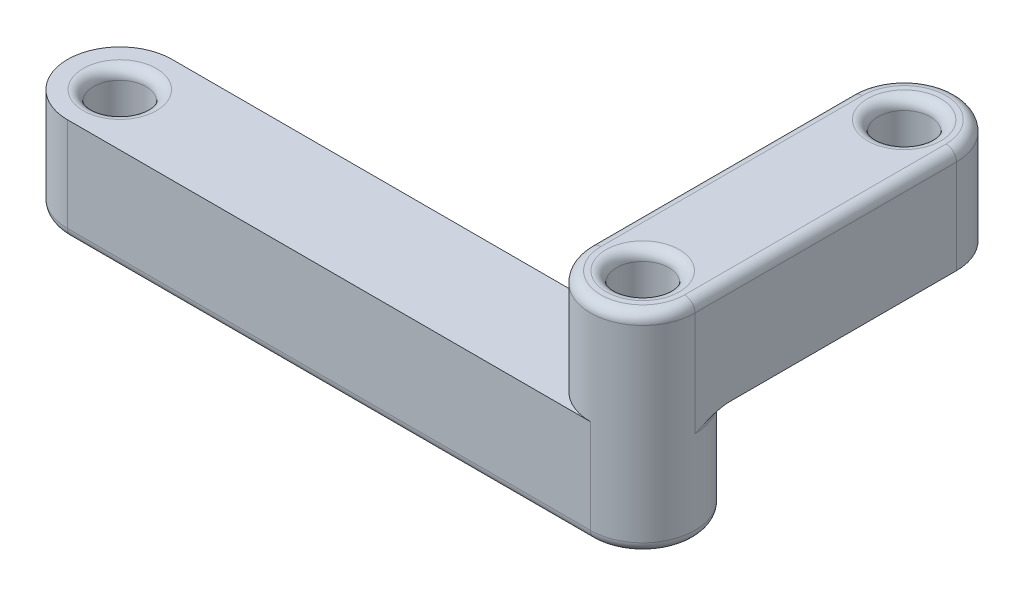
ISO-10303-21;
HEADER;
FILE_DESCRIPTION(('STEP AP214'),'2;1');
FILE_NAME('part.step','',(''),(''),'','','');
FILE_SCHEMA(('AUTOMOTIVE_DESIGN { 1 0 10303 214 1 1 1 1 }'));
ENDSEC;
DATA;
#1=APPLICATION_CONTEXT('core data for automotive mechanical design processes');
#2=APPLICATION_PROTOCOL_DEFINITION('international standard','automotive_design',2000,#1);
#3=PRODUCT_CONTEXT('',#1,'mechanical');
#4=PRODUCT('Part','Part','',(#3));
#5=PRODUCT_RELATED_PRODUCT_CATEGORY('part','',(#4));
#6=PRODUCT_DEFINITION_FORMATION('','',#4);
#7=PRODUCT_DEFINITION_CONTEXT('part definition',#1,'design');
#8=PRODUCT_DEFINITION('design','',#6,#7);
#9=PRODUCT_DEFINITION_SHAPE('','',#8);
#10=(LENGTH_UNIT() NAMED_UNIT(*) SI_UNIT(.MILLI.,.METRE.));
#11=(NAMED_UNIT(*) PLANE_ANGLE_UNIT() SI_UNIT($,.RADIAN.));
#12=(NAMED_UNIT(*) SI_UNIT($,.STERADIAN.) SOLID_ANGLE_UNIT());
#13=UNCERTAINTY_MEASURE_WITH_UNIT(LENGTH_MEASURE(1.E-05),#10,'distance_accuracy_value','');
#14=(GEOMETRIC_REPRESENTATION_CONTEXT(3) GLOBAL_UNCERTAINTY_ASSIGNED_CONTEXT((#13)) GLOBAL_UNIT_ASSIGNED_CONTEXT((#10,
#11,#12)) REPRESENTATION_CONTEXT('',''));
#15=CARTESIAN_POINT('',(0.,0.,0.));
#16=DIRECTION('',(0.,0.,1.));
#17=DIRECTION('',(1.,0.,0.));
#18=AXIS2_PLACEMENT_3D('',#15,#16,#17);
#19=CARTESIAN_POINT('',(0.,10.,0.));
#20=DIRECTION('',(0.,1.,0.));
#21=DIRECTION('',(0.,0.,1.));
#22=AXIS2_PLACEMENT_3D('',#19,#20,#21);
#23=PLANE('',#22);
#24=CARTESIAN_POINT('',(0.,10.,0.));
#25=DIRECTION('',(0.,1.,0.));
#26=DIRECTION('',(0.,0.,1.));
#27=AXIS2_PLACEMENT_3D('',#24,#25,#26);
#28=CIRCLE('',#27,3.5);
#29=CARTESIAN_POINT('',(0.,10.,3.5));
#30=VERTEX_POINT('',#29);
#31=EDGE_CURVE('E322',#30,#30,#28,.F.);
#32=ORIENTED_EDGE('',*,*,#31,.T.);
#33=EDGE_LOOP('',(#32));
#34=FACE_BOUND('',#33,.T.);
#35=CARTESIAN_POINT('',(50.,10.,0.));
#36=DIRECTION('',(0.,1.,0.));
#37=DIRECTION('',(0.,0.,1.));
#38=AXIS2_PLACEMENT_3D('',#35,#36,#37);
#39=CIRCLE('',#38,5.);
#40=CARTESIAN_POINT('',(45.,10.,0.));
#41=VERTEX_POINT('',#40);
#42=CARTESIAN_POINT('',(50.,10.,5.));
#43=VERTEX_POINT('',#42);
#44=EDGE_CURVE('E169',#41,#43,#39,.T.);
#45=ORIENTED_EDGE('',*,*,#44,.F.);
#46=DIRECTION('',(0.,0.,1.));
#47=VECTOR('',#46,1.);
#48=CARTESIAN_POINT('',(45.,10.,0.));
#49=LINE('',#48,#47);
#50=CARTESIAN_POINT('',(45.,10.,-5.));
#51=VERTEX_POINT('',#50);
#52=EDGE_CURVE('E180',#51,#41,#49,.T.);
#53=ORIENTED_EDGE('',*,*,#52,.F.);
#54=DIRECTION('',(-1.,0.,0.));
#55=VECTOR('',#54,1.);
#56=CARTESIAN_POINT('',(0.,10.,-5.));
#57=LINE('',#56,#55);
#58=CARTESIAN_POINT('',(0.,10.,-5.));
#59=VERTEX_POINT('',#58);
#60=EDGE_CURVE('E196',#51,#59,#57,.T.);
#61=ORIENTED_EDGE('',*,*,#60,.T.);
#62=CARTESIAN_POINT('',(0.,10.,0.));
#63=DIRECTION('',(0.,1.,0.));
#64=DIRECTION('',(0.,0.,1.));
#65=AXIS2_PLACEMENT_3D('',#62,#63,#64);
#66=CIRCLE('',#65,5.);
#67=CARTESIAN_POINT('',(0.,10.,5.));
#68=VERTEX_POINT('',#67);
#69=EDGE_CURVE('E189',#59,#68,#66,.T.);
#70=ORIENTED_EDGE('',*,*,#69,.T.);
#71=DIRECTION('',(1.,0.,0.));
#72=VECTOR('',#71,1.);
#73=CARTESIAN_POINT('',(0.,10.,5.));
#74=LINE('',#73,#72);
#75=EDGE_CURVE('E193',#68,#43,#74,.T.);
#76=ORIENTED_EDGE('',*,*,#75,.T.);
#77=EDGE_LOOP('',(#45,#53,#61,#70,#76));
#78=FACE_BOUND('',#77,.T.);
#79=ADVANCED_FACE('F38',(#34,#78),#23,.T.);
#80=CARTESIAN_POINT('',(0.,0.,0.));
#81=DIRECTION('',(0.,1.,0.));
#82=DIRECTION('',(0.,0.,1.));
#83=AXIS2_PLACEMENT_3D('',#80,#81,#82);
#84=PLANE('',#83);
#85=CARTESIAN_POINT('',(50.,0.,0.));
#86=DIRECTION('',(0.,1.,0.));
#87=DIRECTION('',(0.,0.,1.));
#88=AXIS2_PLACEMENT_3D('',#85,#86,#87);
#89=CIRCLE('',#88,3.5);
#90=CARTESIAN_POINT('',(50.,0.,3.5));
#91=VERTEX_POINT('',#90);
#92=EDGE_CURVE('E304',#91,#91,#89,.T.);
#93=ORIENTED_EDGE('',*,*,#92,.T.);
#94=EDGE_LOOP('',(#93));
#95=FACE_BOUND('',#94,.T.);
#96=CARTESIAN_POINT('',(0.,0.,0.));
#97=DIRECTION('',(0.,1.,0.));
#98=DIRECTION('',(0.,0.,1.));
#99=AXIS2_PLACEMENT_3D('',#96,#97,#98);
#100=CIRCLE('',#99,3.5);
#101=CARTESIAN_POINT('',(0.,0.,3.5));
#102=VERTEX_POINT('',#101);
#103=EDGE_CURVE('E300',#102,#102,#100,.T.);
#104=ORIENTED_EDGE('',*,*,#103,.T.);
#105=EDGE_LOOP('',(#104));
#106=FACE_BOUND('',#105,.T.);
#107=CARTESIAN_POINT('',(50.,0.,0.));
#108=DIRECTION('',(0.,1.,0.));
#109=DIRECTION('',(0.,0.,1.));
#110=AXIS2_PLACEMENT_3D('',#107,#108,#109);
#111=CIRCLE('',#110,4.);
#112=CARTESIAN_POINT('',(50.,0.,-4.));
#113=VERTEX_POINT('',#112);
#114=CARTESIAN_POINT('',(50.,0.,4.));
#115=VERTEX_POINT('',#114);
#116=EDGE_CURVE('E293',#113,#115,#111,.F.);
#117=ORIENTED_EDGE('',*,*,#116,.T.);
#118=DIRECTION('',(1.,0.,0.));
#119=VECTOR('',#118,1.);
#120=CARTESIAN_POINT('',(0.,0.,4.));
#121=LINE('',#120,#119);
#122=CARTESIAN_POINT('',(0.,0.,4.));
#123=VERTEX_POINT('',#122);
#124=EDGE_CURVE('E296',#115,#123,#121,.F.);
#125=ORIENTED_EDGE('',*,*,#124,.T.);
#126=CARTESIAN_POINT('',(0.,0.,0.));
#127=DIRECTION('',(0.,1.,0.));
#128=DIRECTION('',(0.,0.,1.));
#129=AXIS2_PLACEMENT_3D('',#126,#127,#128);
#130=CIRCLE('',#129,4.);
#131=CARTESIAN_POINT('',(0.,0.,-4.));
#132=VERTEX_POINT('',#131);
#133=EDGE_CURVE('E287',#123,#132,#130,.F.);
#134=ORIENTED_EDGE('',*,*,#133,.T.);
#135=DIRECTION('',(-1.,0.,0.));
#136=VECTOR('',#135,1.);
#137=CARTESIAN_POINT('',(0.,0.,-4.));
#138=LINE('',#137,#136);
#139=EDGE_CURVE('E290',#132,#113,#138,.F.);
#140=ORIENTED_EDGE('',*,*,#139,.T.);
#141=EDGE_LOOP('',(#117,#125,#134,#140));
#142=FACE_BOUND('',#141,.T.);
#143=ADVANCED_FACE('F357',(#95,#106,#142),#84,.F.);
#144=CARTESIAN_POINT('',(0.,10.,0.));
#145=DIRECTION('',(0.,-1.,0.));
#146=DIRECTION('',(0.,0.,-1.));
#147=AXIS2_PLACEMENT_3D('',#144,#145,#146);
#148=CYLINDRICAL_SURFACE('',#147,5.);
#149=DIRECTION('',(0.,-1.,0.));
#150=VECTOR('',#149,1.);
#151=CARTESIAN_POINT('',(0.,10.,-5.));
#152=LINE('',#151,#150);
#153=CARTESIAN_POINT('',(0.,0.999999999999999,-5.));
#154=VERTEX_POINT('',#153);
#155=EDGE_CURVE('E199',#59,#154,#152,.T.);
#156=ORIENTED_EDGE('',*,*,#155,.T.);
#157=CARTESIAN_POINT('',(0.,0.999999999999999,0.));
#158=DIRECTION('',(0.,1.,0.));
#159=DIRECTION('',(0.,0.,1.));
#160=AXIS2_PLACEMENT_3D('',#157,#158,#159);
#161=CIRCLE('',#160,5.);
#162=CARTESIAN_POINT('',(0.,0.999999999999999,5.));
#163=VERTEX_POINT('',#162);
#164=EDGE_CURVE('E64',#154,#163,#161,.T.);
#165=ORIENTED_EDGE('',*,*,#164,.T.);
#166=DIRECTION('',(0.,-1.,0.));
#167=VECTOR('',#166,1.);
#168=CARTESIAN_POINT('',(0.,10.,5.));
#169=LINE('',#168,#167);
#170=EDGE_CURVE('E210',#68,#163,#169,.T.);
#171=ORIENTED_EDGE('',*,*,#170,.F.);
#172=ORIENTED_EDGE('',*,*,#69,.F.);
#173=EDGE_LOOP('',(#156,#165,#171,#172));
#174=FACE_BOUND('',#173,.T.);
#175=ADVANCED_FACE('F361',(#174),#148,.T.);
#176=CARTESIAN_POINT('',(0.,10.,5.));
#177=DIRECTION('',(0.,0.,-1.));
#178=DIRECTION('',(-1.,0.,0.));
#179=AXIS2_PLACEMENT_3D('',#176,#177,#178);
#180=PLANE('',#179);
#181=ORIENTED_EDGE('',*,*,#170,.T.);
#182=DIRECTION('',(1.,0.,0.));
#183=VECTOR('',#182,1.);
#184=CARTESIAN_POINT('',(0.,0.999999999999999,5.));
#185=LINE('',#184,#183);
#186=CARTESIAN_POINT('',(50.,0.999999999999999,5.));
#187=VERTEX_POINT('',#186);
#188=EDGE_CURVE('E316',#163,#187,#185,.T.);
#189=ORIENTED_EDGE('',*,*,#188,.T.);
#190=DIRECTION('',(0.,-1.,0.));
#191=VECTOR('',#190,1.);
#192=CARTESIAN_POINT('',(50.,10.,5.));
#193=LINE('',#192,#191);
#194=EDGE_CURVE('E206',#43,#187,#193,.T.);
#195=ORIENTED_EDGE('',*,*,#194,.F.);
#196=ORIENTED_EDGE('',*,*,#75,.F.);
#197=EDGE_LOOP('',(#181,#189,#195,#196));
#198=FACE_BOUND('',#197,.T.);
#199=ADVANCED_FACE('F369',(#198),#180,.F.);
#200=CARTESIAN_POINT('',(50.,10.,0.));
#201=DIRECTION('',(0.,-1.,0.));
#202=DIRECTION('',(0.,0.,-1.));
#203=AXIS2_PLACEMENT_3D('',#200,#201,#202);
#204=CYLINDRICAL_SURFACE('',#203,5.);
#205=DIRECTION('',(0.,-1.,0.));
#206=VECTOR('',#205,1.);
#207=CARTESIAN_POINT('',(55.,20.,0.));
#208=LINE('',#207,#206);
#209=CARTESIAN_POINT('',(55.,19.,0.));
#210=VERTEX_POINT('',#209);
#211=CARTESIAN_POINT('',(55.,9.,0.));
#212=VERTEX_POINT('',#211);
#213=EDGE_CURVE('E159',#210,#212,#208,.T.);
#214=ORIENTED_EDGE('',*,*,#213,.F.);
#215=CARTESIAN_POINT('',(50.,19.,0.));
#216=DIRECTION('',(0.,1.,0.));
#217=DIRECTION('',(0.,0.,1.));
#218=AXIS2_PLACEMENT_3D('',#215,#216,#217);
#219=CIRCLE('',#218,5.);
#220=CARTESIAN_POINT('',(45.,19.,0.));
#221=VERTEX_POINT('',#220);
#222=EDGE_CURVE('E276',#210,#221,#219,.F.);
#223=ORIENTED_EDGE('',*,*,#222,.T.);
#224=DIRECTION('',(0.,-1.,0.));
#225=VECTOR('',#224,1.);
#226=CARTESIAN_POINT('',(45.,20.,0.));
#227=LINE('',#226,#225);
#228=EDGE_CURVE('E178',#221,#41,#227,.T.);
#229=ORIENTED_EDGE('',*,*,#228,.T.);
#230=ORIENTED_EDGE('',*,*,#44,.T.);
#231=ORIENTED_EDGE('',*,*,#194,.T.);
#232=CARTESIAN_POINT('',(50.,0.999999999999999,0.));
#233=DIRECTION('',(0.,1.,0.));
#234=DIRECTION('',(0.,0.,1.));
#235=AXIS2_PLACEMENT_3D('',#232,#233,#234);
#236=CIRCLE('',#235,5.);
#237=CARTESIAN_POINT('',(50.,0.999999999999999,-5.));
#238=VERTEX_POINT('',#237);
#239=EDGE_CURVE('E273',#187,#238,#236,.T.);
#240=ORIENTED_EDGE('',*,*,#239,.T.);
#241=DIRECTION('',(0.,-1.,0.));
#242=VECTOR('',#241,1.);
#243=CARTESIAN_POINT('',(50.,10.,-5.));
#244=LINE('',#243,#242);
#245=CARTESIAN_POINT('',(50.,9.,-5.));
#246=VERTEX_POINT('',#245);
#247=EDGE_CURVE('E202',#246,#238,#244,.T.);
#248=ORIENTED_EDGE('',*,*,#247,.F.);
#249=CARTESIAN_POINT('',(50.,9.,0.));
#250=DIRECTION('',(0.,1.,0.));
#251=DIRECTION('',(0.,0.,1.));
#252=AXIS2_PLACEMENT_3D('',#249,#250,#251);
#253=CIRCLE('',#252,5.);
#254=EDGE_CURVE('E269',#246,#212,#253,.F.);
#255=ORIENTED_EDGE('',*,*,#254,.T.);
#256=EDGE_LOOP('',(#214,#223,#229,#230,#231,#240,#248,#255));
#257=FACE_BOUND('',#256,.T.);
#258=ADVANCED_FACE('F365',(#257),#204,.T.);
#259=CARTESIAN_POINT('',(0.,10.,-5.));
#260=DIRECTION('',(0.,0.,1.));
#261=DIRECTION('',(1.,0.,0.));
#262=AXIS2_PLACEMENT_3D('',#259,#260,#261);
#263=PLANE('',#262);
#264=ORIENTED_EDGE('',*,*,#60,.F.);
#265=DIRECTION('',(0.,-1.,0.));
#266=VECTOR('',#265,1.);
#267=CARTESIAN_POINT('',(45.,20.,-5.));
#268=LINE('',#267,#266);
#269=CARTESIAN_POINT('',(45.,9.,-5.));
#270=VERTEX_POINT('',#269);
#271=EDGE_CURVE('E56',#51,#270,#268,.T.);
#272=ORIENTED_EDGE('',*,*,#271,.T.);
#273=DIRECTION('',(-1.,0.,0.));
#274=VECTOR('',#273,1.);
#275=CARTESIAN_POINT('',(50.,9.,-5.));
#276=LINE('',#275,#274);
#277=EDGE_CURVE('E226',#270,#246,#276,.F.);
#278=ORIENTED_EDGE('',*,*,#277,.T.);
#279=ORIENTED_EDGE('',*,*,#247,.T.);
#280=DIRECTION('',(-1.,0.,0.));
#281=VECTOR('',#280,1.);
#282=CARTESIAN_POINT('',(0.,0.999999999999999,-5.));
#283=LINE('',#282,#281);
#284=EDGE_CURVE('E223',#238,#154,#283,.T.);
#285=ORIENTED_EDGE('',*,*,#284,.T.);
#286=ORIENTED_EDGE('',*,*,#155,.F.);
#287=EDGE_LOOP('',(#264,#272,#278,#279,#285,#286));
#288=FACE_BOUND('',#287,.T.);
#289=ADVANCED_FACE('F353',(#288),#263,.F.);
#290=CARTESIAN_POINT('',(0.,10.,0.));
#291=DIRECTION('',(0.,-1.,0.));
#292=DIRECTION('',(0.,0.,-1.));
#293=AXIS2_PLACEMENT_3D('',#290,#291,#292);
#294=CYLINDRICAL_SURFACE('',#293,2.5);
#295=CARTESIAN_POINT('',(0.,0.999999999999999,0.));
#296=DIRECTION('',(0.,1.,0.));
#297=DIRECTION('',(0.,0.,1.));
#298=AXIS2_PLACEMENT_3D('',#295,#296,#297);
#299=CIRCLE('',#298,2.5);
#300=CARTESIAN_POINT('',(0.,0.999999999999999,2.5));
#301=VERTEX_POINT('',#300);
#302=EDGE_CURVE('E312',#301,#301,#299,.F.);
#303=ORIENTED_EDGE('',*,*,#302,.T.);
#304=EDGE_LOOP('',(#303));
#305=FACE_BOUND('',#304,.T.);
#306=CARTESIAN_POINT('',(0.,9.,0.));
#307=DIRECTION('',(0.,1.,0.));
#308=DIRECTION('',(0.,0.,1.));
#309=AXIS2_PLACEMENT_3D('',#306,#307,#308);
#310=CIRCLE('',#309,2.5);
#311=CARTESIAN_POINT('',(0.,9.,2.5));
#312=VERTEX_POINT('',#311);
#313=EDGE_CURVE('E308',#312,#312,#310,.T.);
#314=ORIENTED_EDGE('',*,*,#313,.T.);
#315=EDGE_LOOP('',(#314));
#316=FACE_BOUND('',#315,.T.);
#317=ADVANCED_FACE('F349',(#305,#316),#294,.F.);
#318=CARTESIAN_POINT('',(50.,10.,0.));
#319=DIRECTION('',(0.,-1.,0.));
#320=DIRECTION('',(0.,0.,-1.));
#321=AXIS2_PLACEMENT_3D('',#318,#319,#320);
#322=CYLINDRICAL_SURFACE('',#321,2.5);
#323=CARTESIAN_POINT('',(50.,19.,0.));
#324=DIRECTION('',(0.,1.,0.));
#325=DIRECTION('',(0.,0.,1.));
#326=AXIS2_PLACEMENT_3D('',#323,#324,#325);
#327=CIRCLE('',#326,2.5);
#328=CARTESIAN_POINT('',(50.,19.,2.5));
#329=VERTEX_POINT('',#328);
#330=EDGE_CURVE('E283',#329,#329,#327,.T.);
#331=ORIENTED_EDGE('',*,*,#330,.T.);
#332=EDGE_LOOP('',(#331));
#333=FACE_BOUND('',#332,.T.);
#334=CARTESIAN_POINT('',(50.,0.999999999999999,0.));
#335=DIRECTION('',(0.,1.,0.));
#336=DIRECTION('',(0.,0.,1.));
#337=AXIS2_PLACEMENT_3D('',#334,#335,#336);
#338=CIRCLE('',#337,2.5);
#339=CARTESIAN_POINT('',(50.,0.999999999999999,2.5));
#340=VERTEX_POINT('',#339);
#341=EDGE_CURVE('E279',#340,#340,#338,.F.);
#342=ORIENTED_EDGE('',*,*,#341,.T.);
#343=EDGE_LOOP('',(#342));
#344=FACE_BOUND('',#343,.T.);
#345=ADVANCED_FACE('F346',(#333,#344),#322,.F.);
#346=CARTESIAN_POINT('',(50.,10.,0.));
#347=DIRECTION('',(0.,1.,0.));
#348=DIRECTION('',(0.,0.,1.));
#349=AXIS2_PLACEMENT_3D('',#346,#347,#348);
#350=PLANE('',#349);
#351=CARTESIAN_POINT('',(50.,10.,-25.));
#352=DIRECTION('',(0.,1.,0.));
#353=DIRECTION('',(0.,0.,1.));
#354=AXIS2_PLACEMENT_3D('',#351,#352,#353);
#355=CIRCLE('',#354,3.5);
#356=CARTESIAN_POINT('',(50.,10.,-21.5));
#357=VERTEX_POINT('',#356);
#358=EDGE_CURVE('E219',#357,#357,#355,.T.);
#359=ORIENTED_EDGE('',*,*,#358,.T.);
#360=EDGE_LOOP('',(#359));
#361=FACE_BOUND('',#360,.T.);
#362=CARTESIAN_POINT('',(50.,10.,0.));
#363=DIRECTION('',(0.,1.,0.));
#364=DIRECTION('',(0.,0.,1.));
#365=AXIS2_PLACEMENT_3D('',#362,#363,#364);
#366=CIRCLE('',#365,6.);
#367=CARTESIAN_POINT('',(55.,10.,-3.3166247903554));
#368=VERTEX_POINT('',#367);
#369=CARTESIAN_POINT('',(50.,10.,-6.));
#370=VERTEX_POINT('',#369);
#371=EDGE_CURVE('E213',#368,#370,#366,.T.);
#372=ORIENTED_EDGE('',*,*,#371,.T.);
#373=DIRECTION('',(-1.,0.,0.));
#374=VECTOR('',#373,1.);
#375=CARTESIAN_POINT('',(45.,10.,-6.));
#376=LINE('',#375,#374);
#377=CARTESIAN_POINT('',(45.,10.,-6.));
#378=VERTEX_POINT('',#377);
#379=EDGE_CURVE('E216',#370,#378,#376,.T.);
#380=ORIENTED_EDGE('',*,*,#379,.T.);
#381=CARTESIAN_POINT('',(45.,10.,-25.));
#382=VERTEX_POINT('',#381);
#383=EDGE_CURVE('E174',#382,#378,#49,.T.);
#384=ORIENTED_EDGE('',*,*,#383,.F.);
#385=CARTESIAN_POINT('',(50.,10.,-25.));
#386=DIRECTION('',(0.,1.,0.));
#387=DIRECTION('',(0.,0.,1.));
#388=AXIS2_PLACEMENT_3D('',#385,#386,#387);
#389=CIRCLE('',#388,5.);
#390=CARTESIAN_POINT('',(55.,10.,-25.));
#391=VERTEX_POINT('',#390);
#392=EDGE_CURVE('E152',#391,#382,#389,.T.);
#393=ORIENTED_EDGE('',*,*,#392,.F.);
#394=DIRECTION('',(0.,0.,-1.));
#395=VECTOR('',#394,1.);
#396=CARTESIAN_POINT('',(55.,10.,0.));
#397=LINE('',#396,#395);
#398=EDGE_CURVE('E163',#368,#391,#397,.T.);
#399=ORIENTED_EDGE('',*,*,#398,.F.);
#400=EDGE_LOOP('',(#372,#380,#384,#393,#399));
#401=FACE_BOUND('',#400,.T.);
#402=ADVANCED_FACE('F171',(#361,#401),#350,.F.);
#403=CARTESIAN_POINT('',(50.,20.,0.));
#404=DIRECTION('',(0.,1.,0.));
#405=DIRECTION('',(0.,0.,1.));
#406=AXIS2_PLACEMENT_3D('',#403,#404,#405);
#407=PLANE('',#406);
#408=CARTESIAN_POINT('',(50.,20.,-25.));
#409=DIRECTION('',(0.,1.,0.));
#410=DIRECTION('',(0.,0.,1.));
#411=AXIS2_PLACEMENT_3D('',#408,#409,#410);
#412=CIRCLE('',#411,3.5);
#413=CARTESIAN_POINT('',(50.,20.,-21.5));
#414=VERTEX_POINT('',#413);
#415=EDGE_CURVE('E256',#414,#414,#412,.F.);
#416=ORIENTED_EDGE('',*,*,#415,.T.);
#417=EDGE_LOOP('',(#416));
#418=FACE_BOUND('',#417,.T.);
#419=CARTESIAN_POINT('',(50.,20.,-25.));
#420=DIRECTION('',(0.,1.,0.));
#421=DIRECTION('',(0.,0.,1.));
#422=AXIS2_PLACEMENT_3D('',#419,#420,#421);
#423=CIRCLE('',#422,4.);
#424=CARTESIAN_POINT('',(54.,20.,-25.));
#425=VERTEX_POINT('',#424);
#426=CARTESIAN_POINT('',(46.,20.,-25.));
#427=VERTEX_POINT('',#426);
#428=EDGE_CURVE('E249',#425,#427,#423,.T.);
#429=ORIENTED_EDGE('',*,*,#428,.T.);
#430=DIRECTION('',(0.,0.,1.));
#431=VECTOR('',#430,1.);
#432=CARTESIAN_POINT('',(46.,20.,0.));
#433=LINE('',#432,#431);
#434=CARTESIAN_POINT('',(46.,20.,0.));
#435=VERTEX_POINT('',#434);
#436=EDGE_CURVE('E252',#427,#435,#433,.T.);
#437=ORIENTED_EDGE('',*,*,#436,.T.);
#438=CARTESIAN_POINT('',(50.,20.,0.));
#439=DIRECTION('',(0.,1.,0.));
#440=DIRECTION('',(0.,0.,1.));
#441=AXIS2_PLACEMENT_3D('',#438,#439,#440);
#442=CIRCLE('',#441,4.);
#443=CARTESIAN_POINT('',(54.,20.,0.));
#444=VERTEX_POINT('',#443);
#445=EDGE_CURVE('E243',#435,#444,#442,.T.);
#446=ORIENTED_EDGE('',*,*,#445,.T.);
#447=DIRECTION('',(0.,0.,-1.));
#448=VECTOR('',#447,1.);
#449=CARTESIAN_POINT('',(54.,20.,-25.));
#450=LINE('',#449,#448);
#451=EDGE_CURVE('E246',#444,#425,#450,.T.);
#452=ORIENTED_EDGE('',*,*,#451,.T.);
#453=EDGE_LOOP('',(#429,#437,#446,#452));
#454=FACE_BOUND('',#453,.T.);
#455=CARTESIAN_POINT('',(50.,20.,0.));
#456=DIRECTION('',(0.,1.,0.));
#457=DIRECTION('',(0.,0.,1.));
#458=AXIS2_PLACEMENT_3D('',#455,#456,#457);
#459=CIRCLE('',#458,3.5);
#460=CARTESIAN_POINT('',(50.,20.,3.5));
#461=VERTEX_POINT('',#460);
#462=EDGE_CURVE('E239',#461,#461,#459,.F.);
#463=ORIENTED_EDGE('',*,*,#462,.T.);
#464=EDGE_LOOP('',(#463));
#465=FACE_BOUND('',#464,.T.);
#466=ADVANCED_FACE('F344',(#418,#454,#465),#407,.T.);
#467=CARTESIAN_POINT('',(55.,20.,0.));
#468=DIRECTION('',(-1.,0.,0.));
#469=DIRECTION('',(0.,0.,1.));
#470=AXIS2_PLACEMENT_3D('',#467,#468,#469);
#471=PLANE('',#470);
#472=DIRECTION('',(0.,-1.,0.));
#473=VECTOR('',#472,1.);
#474=CARTESIAN_POINT('',(55.,20.,-25.));
#475=LINE('',#474,#473);
#476=CARTESIAN_POINT('',(55.,19.,-25.));
#477=VERTEX_POINT('',#476);
#478=EDGE_CURVE('E147',#477,#391,#475,.T.);
#479=ORIENTED_EDGE('',*,*,#478,.F.);
#480=DIRECTION('',(0.,0.,-1.));
#481=VECTOR('',#480,1.);
#482=CARTESIAN_POINT('',(55.,19.,0.));
#483=LINE('',#482,#481);
#484=EDGE_CURVE('E266',#477,#210,#483,.F.);
#485=ORIENTED_EDGE('',*,*,#484,.T.);
#486=ORIENTED_EDGE('',*,*,#213,.T.);
#487=CARTESIAN_POINT('',(55.,10.,-3.3166247903554));
#488=CARTESIAN_POINT('',(55.,9.99999265512221,-3.25494482619008));
#489=CARTESIAN_POINT('',(55.,9.99825737047963,-3.19328962812761));
#490=CARTESIAN_POINT('',(55.,9.99167927723068,-3.07017847661111));
#491=CARTESIAN_POINT('',(55.,9.9868382841348,-3.00872242782101));
#492=CARTESIAN_POINT('',(55.,9.96821224203602,-2.82513313063131));
#493=CARTESIAN_POINT('',(55.,9.95031992154743,-2.70341157012645));
#494=CARTESIAN_POINT('',(55.,9.9060386621471,-2.46297288415124));
#495=CARTESIAN_POINT('',(55.,9.87974501632836,-2.34423745067143));
#496=CARTESIAN_POINT('',(55.,9.82030252267229,-2.10841461784311));
#497=CARTESIAN_POINT('',(55.,9.78714796093694,-1.99132867959425));
#498=CARTESIAN_POINT('',(55.,9.70207510058657,-1.71551124098912));
#499=CARTESIAN_POINT('',(55.,9.64776910285603,-1.55752384188438));
#500=CARTESIAN_POINT('',(55.,9.53204394783059,-1.24415550470578));
#501=CARTESIAN_POINT('',(55.,9.47062179236419,-1.08877569705426));
#502=CARTESIAN_POINT('',(55.,9.27926384080067,-0.624630036707562));
#503=CARTESIAN_POINT('',(55.,9.14253295535513,-0.318715820675118));
#504=CARTESIAN_POINT('',(55.,9.00384898304987,-0.00860661879758964));
#505=CARTESIAN_POINT('',(55.,9.00192448179476,-0.00430330380789882));
#506=CARTESIAN_POINT('',(55.,9.,0.));
#507=B_SPLINE_CURVE_WITH_KNOTS('',3,(#487,#488,#489,#490,#491,#492,#493,#494,#495,#496,#497,
#498,#499,#500,#501,#502,#503,#504,#505,#506),.UNSPECIFIED.,.F.,.F.,(4,2,2,2,2,2,2,2,2,4),(0.,
0.18497719233711,0.369846350578148,0.738487583100217,1.1030876409053,1.46799257532017,
1.96890994139287,2.47003912618606,3.47501470229638,3.48915683792113),.UNSPECIFIED.);
#508=EDGE_CURVE('E11',#212,#368,#507,.F.);
#509=ORIENTED_EDGE('',*,*,#508,.T.);
#510=ORIENTED_EDGE('',*,*,#398,.T.);
#511=EDGE_LOOP('',(#479,#485,#486,#509,#510));
#512=FACE_BOUND('',#511,.T.);
#513=ADVANCED_FACE('F164',(#512),#471,.F.);
#514=CARTESIAN_POINT('',(50.,20.,-25.));
#515=DIRECTION('',(0.,-1.,0.));
#516=DIRECTION('',(0.,0.,-1.));
#517=AXIS2_PLACEMENT_3D('',#514,#515,#516);
#518=CYLINDRICAL_SURFACE('',#517,5.);
#519=DIRECTION('',(0.,-1.,0.));
#520=VECTOR('',#519,1.);
#521=CARTESIAN_POINT('',(45.,20.,-25.));
#522=LINE('',#521,#520);
#523=CARTESIAN_POINT('',(45.,19.,-25.));
#524=VERTEX_POINT('',#523);
#525=EDGE_CURVE('E160',#524,#382,#522,.T.);
#526=ORIENTED_EDGE('',*,*,#525,.F.);
#527=CARTESIAN_POINT('',(50.,19.,-25.));
#528=DIRECTION('',(0.,1.,0.));
#529=DIRECTION('',(0.,0.,1.));
#530=AXIS2_PLACEMENT_3D('',#527,#528,#529);
#531=CIRCLE('',#530,5.);
#532=EDGE_CURVE('E155',#524,#477,#531,.F.);
#533=ORIENTED_EDGE('',*,*,#532,.T.);
#534=ORIENTED_EDGE('',*,*,#478,.T.);
#535=ORIENTED_EDGE('',*,*,#392,.T.);
#536=EDGE_LOOP('',(#526,#533,#534,#535));
#537=FACE_BOUND('',#536,.T.);
#538=ADVANCED_FACE('F150',(#537),#518,.T.);
#539=CARTESIAN_POINT('',(45.,20.,0.));
#540=DIRECTION('',(1.,0.,0.));
#541=DIRECTION('',(0.,0.,-1.));
#542=AXIS2_PLACEMENT_3D('',#539,#540,#541);
#543=PLANE('',#542);
#544=ORIENTED_EDGE('',*,*,#228,.F.);
#545=DIRECTION('',(0.,0.,1.));
#546=VECTOR('',#545,1.);
#547=CARTESIAN_POINT('',(45.,19.,-25.));
#548=LINE('',#547,#546);
#549=EDGE_CURVE('E260',#221,#524,#548,.F.);
#550=ORIENTED_EDGE('',*,*,#549,.T.);
#551=ORIENTED_EDGE('',*,*,#525,.T.);
#552=ORIENTED_EDGE('',*,*,#383,.T.);
#553=CARTESIAN_POINT('',(45.,9.,-6.));
#554=DIRECTION('',(1.,0.,0.));
#555=DIRECTION('',(0.,0.,-1.));
#556=AXIS2_PLACEMENT_3D('',#553,#554,#555);
#557=CIRCLE('',#556,1.);
#558=EDGE_CURVE('E48',#378,#270,#557,.T.);
#559=ORIENTED_EDGE('',*,*,#558,.T.);
#560=ORIENTED_EDGE('',*,*,#271,.F.);
#561=ORIENTED_EDGE('',*,*,#52,.T.);
#562=EDGE_LOOP('',(#544,#550,#551,#552,#559,#560,#561));
#563=FACE_BOUND('',#562,.T.);
#564=ADVANCED_FACE('F438',(#563),#543,.F.);
#565=CARTESIAN_POINT('',(50.,20.,-25.));
#566=DIRECTION('',(0.,-1.,0.));
#567=DIRECTION('',(0.,0.,-1.));
#568=AXIS2_PLACEMENT_3D('',#565,#566,#567);
#569=CYLINDRICAL_SURFACE('',#568,2.5);
#570=CARTESIAN_POINT('',(50.,19.,-25.));
#571=DIRECTION('',(0.,1.,0.));
#572=DIRECTION('',(0.,0.,1.));
#573=AXIS2_PLACEMENT_3D('',#570,#571,#572);
#574=CIRCLE('',#573,2.5);
#575=CARTESIAN_POINT('',(50.,19.,-22.5));
#576=VERTEX_POINT('',#575);
#577=EDGE_CURVE('E235',#576,#576,#574,.T.);
#578=ORIENTED_EDGE('',*,*,#577,.T.);
#579=EDGE_LOOP('',(#578));
#580=FACE_BOUND('',#579,.T.);
#581=CARTESIAN_POINT('',(50.,11.,-25.));
#582=DIRECTION('',(0.,1.,0.));
#583=DIRECTION('',(0.,0.,1.));
#584=AXIS2_PLACEMENT_3D('',#581,#582,#583);
#585=CIRCLE('',#584,2.5);
#586=CARTESIAN_POINT('',(50.,11.,-22.5));
#587=VERTEX_POINT('',#586);
#588=EDGE_CURVE('E231',#587,#587,#585,.F.);
#589=ORIENTED_EDGE('',*,*,#588,.T.);
#590=EDGE_LOOP('',(#589));
#591=FACE_BOUND('',#590,.T.);
#592=ADVANCED_FACE('F385',(#580,#591),#569,.F.);
#593=CARTESIAN_POINT('',(50.,9.,0.));
#594=DIRECTION('',(0.,1.,0.));
#595=DIRECTION('',(0.,0.,1.));
#596=AXIS2_PLACEMENT_3D('',#593,#594,#595);
#597=TOROIDAL_SURFACE('',#596,6.,1.);
#598=ORIENTED_EDGE('',*,*,#508,.F.);
#599=ORIENTED_EDGE('',*,*,#254,.F.);
#600=CARTESIAN_POINT('',(50.,9.,-6.));
#601=DIRECTION('',(1.,0.,0.));
#602=DIRECTION('',(0.,0.,-1.));
#603=AXIS2_PLACEMENT_3D('',#600,#601,#602);
#604=CIRCLE('',#603,1.);
#605=EDGE_CURVE('E334',#370,#246,#604,.T.);
#606=ORIENTED_EDGE('',*,*,#605,.F.);
#607=ORIENTED_EDGE('',*,*,#371,.F.);
#608=EDGE_LOOP('',(#598,#599,#606,#607));
#609=FACE_BOUND('',#608,.T.);
#610=ADVANCED_FACE('F336',(#609),#597,.F.);
#611=CARTESIAN_POINT('',(50.,9.,-6.));
#612=DIRECTION('',(1.,0.,0.));
#613=DIRECTION('',(0.,0.,-1.));
#614=AXIS2_PLACEMENT_3D('',#611,#612,#613);
#615=CYLINDRICAL_SURFACE('',#614,1.);
#616=ORIENTED_EDGE('',*,*,#605,.T.);
#617=ORIENTED_EDGE('',*,*,#277,.F.);
#618=ORIENTED_EDGE('',*,*,#558,.F.);
#619=ORIENTED_EDGE('',*,*,#379,.F.);
#620=EDGE_LOOP('',(#616,#617,#618,#619));
#621=FACE_BOUND('',#620,.T.);
#622=ADVANCED_FACE('F375',(#621),#615,.F.);
#623=CARTESIAN_POINT('',(50.,19.,-25.));
#624=DIRECTION('',(0.,1.,0.));
#625=DIRECTION('',(0.,0.,1.));
#626=AXIS2_PLACEMENT_3D('',#623,#624,#625);
#627=TOROIDAL_SURFACE('',#626,3.5,1.);
#628=ORIENTED_EDGE('',*,*,#415,.F.);
#629=EDGE_LOOP('',(#628));
#630=FACE_BOUND('',#629,.T.);
#631=ORIENTED_EDGE('',*,*,#577,.F.);
#632=EDGE_LOOP('',(#631));
#633=FACE_BOUND('',#632,.T.);
#634=ADVANCED_FACE('F377',(#630,#633),#627,.T.);
#635=CARTESIAN_POINT('',(54.,19.,0.));
#636=DIRECTION('',(0.,0.,1.));
#637=DIRECTION('',(1.,0.,0.));
#638=AXIS2_PLACEMENT_3D('',#635,#636,#637);
#639=CYLINDRICAL_SURFACE('',#638,1.);
#640=CARTESIAN_POINT('',(54.,19.,0.));
#641=DIRECTION('',(0.,0.,1.));
#642=DIRECTION('',(1.,0.,0.));
#643=AXIS2_PLACEMENT_3D('',#640,#641,#642);
#644=CIRCLE('',#643,1.);
#645=EDGE_CURVE('E398',#210,#444,#644,.T.);
#646=ORIENTED_EDGE('',*,*,#645,.F.);
#647=ORIENTED_EDGE('',*,*,#484,.F.);
#648=CARTESIAN_POINT('',(54.,19.,-25.));
#649=DIRECTION('',(0.,0.,-1.));
#650=DIRECTION('',(-1.,0.,0.));
#651=AXIS2_PLACEMENT_3D('',#648,#649,#650);
#652=CIRCLE('',#651,1.);
#653=EDGE_CURVE('E393',#425,#477,#652,.T.);
#654=ORIENTED_EDGE('',*,*,#653,.F.);
#655=ORIENTED_EDGE('',*,*,#451,.F.);
#656=EDGE_LOOP('',(#646,#647,#654,#655));
#657=FACE_BOUND('',#656,.T.);
#658=ADVANCED_FACE('F383',(#657),#639,.T.);
#659=CARTESIAN_POINT('',(50.,19.,-25.));
#660=DIRECTION('',(0.,1.,0.));
#661=DIRECTION('',(0.,0.,1.));
#662=AXIS2_PLACEMENT_3D('',#659,#660,#661);
#663=TOROIDAL_SURFACE('',#662,4.,1.);
#664=ORIENTED_EDGE('',*,*,#653,.T.);
#665=ORIENTED_EDGE('',*,*,#532,.F.);
#666=CARTESIAN_POINT('',(46.,19.,-25.));
#667=DIRECTION('',(0.,0.,1.));
#668=DIRECTION('',(1.,0.,0.));
#669=AXIS2_PLACEMENT_3D('',#666,#667,#668);
#670=CIRCLE('',#669,1.);
#671=EDGE_CURVE('E405',#427,#524,#670,.T.);
#672=ORIENTED_EDGE('',*,*,#671,.F.);
#673=ORIENTED_EDGE('',*,*,#428,.F.);
#674=EDGE_LOOP('',(#664,#665,#672,#673));
#675=FACE_BOUND('',#674,.T.);
#676=ADVANCED_FACE('F436',(#675),#663,.T.);
#677=CARTESIAN_POINT('',(50.,19.,0.));
#678=DIRECTION('',(0.,1.,0.));
#679=DIRECTION('',(0.,0.,1.));
#680=AXIS2_PLACEMENT_3D('',#677,#678,#679);
#681=TOROIDAL_SURFACE('',#680,4.,1.);
#682=ORIENTED_EDGE('',*,*,#645,.T.);
#683=ORIENTED_EDGE('',*,*,#445,.F.);
#684=CARTESIAN_POINT('',(46.,19.,0.));
#685=DIRECTION('',(0.,0.,-1.));
#686=DIRECTION('',(-1.,0.,0.));
#687=AXIS2_PLACEMENT_3D('',#684,#685,#686);
#688=CIRCLE('',#687,1.);
#689=EDGE_CURVE('E423',#221,#435,#688,.T.);
#690=ORIENTED_EDGE('',*,*,#689,.F.);
#691=ORIENTED_EDGE('',*,*,#222,.F.);
#692=EDGE_LOOP('',(#682,#683,#690,#691));
#693=FACE_BOUND('',#692,.T.);
#694=ADVANCED_FACE('F617',(#693),#681,.T.);
#695=CARTESIAN_POINT('',(46.,19.,0.));
#696=DIRECTION('',(0.,0.,-1.));
#697=DIRECTION('',(-1.,0.,0.));
#698=AXIS2_PLACEMENT_3D('',#695,#696,#697);
#699=CYLINDRICAL_SURFACE('',#698,1.);
#700=ORIENTED_EDGE('',*,*,#671,.T.);
#701=ORIENTED_EDGE('',*,*,#549,.F.);
#702=ORIENTED_EDGE('',*,*,#689,.T.);
#703=ORIENTED_EDGE('',*,*,#436,.F.);
#704=EDGE_LOOP('',(#700,#701,#702,#703));
#705=FACE_BOUND('',#704,.T.);
#706=ADVANCED_FACE('F435',(#705),#699,.T.);
#707=CARTESIAN_POINT('',(50.,19.,0.));
#708=DIRECTION('',(0.,1.,0.));
#709=DIRECTION('',(0.,0.,1.));
#710=AXIS2_PLACEMENT_3D('',#707,#708,#709);
#711=TOROIDAL_SURFACE('',#710,3.5,1.);
#712=ORIENTED_EDGE('',*,*,#462,.F.);
#713=EDGE_LOOP('',(#712));
#714=FACE_BOUND('',#713,.T.);
#715=ORIENTED_EDGE('',*,*,#330,.F.);
#716=EDGE_LOOP('',(#715));
#717=FACE_BOUND('',#716,.T.);
#718=ADVANCED_FACE('F633',(#714,#717),#711,.T.);
#719=CARTESIAN_POINT('',(50.,0.999999999999999,0.));
#720=DIRECTION('',(0.,1.,0.));
#721=DIRECTION('',(0.,0.,1.));
#722=AXIS2_PLACEMENT_3D('',#719,#720,#721);
#723=TOROIDAL_SURFACE('',#722,3.5,1.);
#724=ORIENTED_EDGE('',*,*,#341,.F.);
#725=EDGE_LOOP('',(#724));
#726=FACE_BOUND('',#725,.T.);
#727=ORIENTED_EDGE('',*,*,#92,.F.);
#728=EDGE_LOOP('',(#727));
#729=FACE_BOUND('',#728,.T.);
#730=ADVANCED_FACE('F641',(#726,#729),#723,.T.);
#731=CARTESIAN_POINT('',(0.,0.999999999999999,0.));
#732=DIRECTION('',(0.,1.,0.));
#733=DIRECTION('',(0.,0.,1.));
#734=AXIS2_PLACEMENT_3D('',#731,#732,#733);
#735=TOROIDAL_SURFACE('',#734,3.5,1.);
#736=ORIENTED_EDGE('',*,*,#302,.F.);
#737=EDGE_LOOP('',(#736));
#738=FACE_BOUND('',#737,.T.);
#739=ORIENTED_EDGE('',*,*,#103,.F.);
#740=EDGE_LOOP('',(#739));
#741=FACE_BOUND('',#740,.T.);
#742=ADVANCED_FACE('F473',(#738,#741),#735,.T.);
#743=CARTESIAN_POINT('',(0.,0.999999999999999,-4.));
#744=DIRECTION('',(-1.,0.,0.));
#745=DIRECTION('',(0.,0.,1.));
#746=AXIS2_PLACEMENT_3D('',#743,#744,#745);
#747=CYLINDRICAL_SURFACE('',#746,1.);
#748=CARTESIAN_POINT('',(50.,1.,-4.));
#749=DIRECTION('',(1.,0.,0.));
#750=DIRECTION('',(0.,0.,-1.));
#751=AXIS2_PLACEMENT_3D('',#748,#749,#750);
#752=CIRCLE('',#751,1.);
#753=EDGE_CURVE('E414',#113,#238,#752,.T.);
#754=ORIENTED_EDGE('',*,*,#753,.F.);
#755=ORIENTED_EDGE('',*,*,#139,.F.);
#756=CARTESIAN_POINT('',(0.,0.999999999999999,-4.));
#757=DIRECTION('',(-1.,0.,0.));
#758=DIRECTION('',(0.,0.,1.));
#759=AXIS2_PLACEMENT_3D('',#756,#757,#758);
#760=CIRCLE('',#759,1.);
#761=EDGE_CURVE('E42',#154,#132,#760,.T.);
#762=ORIENTED_EDGE('',*,*,#761,.F.);
#763=ORIENTED_EDGE('',*,*,#284,.F.);
#764=EDGE_LOOP('',(#754,#755,#762,#763));
#765=FACE_BOUND('',#764,.T.);
#766=ADVANCED_FACE('F452',(#765),#747,.T.);
#767=CARTESIAN_POINT('',(0.,0.999999999999999,0.));
#768=DIRECTION('',(0.,1.,0.));
#769=DIRECTION('',(0.,0.,1.));
#770=AXIS2_PLACEMENT_3D('',#767,#768,#769);
#771=TOROIDAL_SURFACE('',#770,4.,1.);
#772=ORIENTED_EDGE('',*,*,#761,.T.);
#773=ORIENTED_EDGE('',*,*,#133,.F.);
#774=CARTESIAN_POINT('',(0.,0.999999999999999,4.));
#775=DIRECTION('',(1.,0.,0.));
#776=DIRECTION('',(0.,0.,-1.));
#777=AXIS2_PLACEMENT_3D('',#774,#775,#776);
#778=CIRCLE('',#777,1.);
#779=EDGE_CURVE('E412',#163,#123,#778,.T.);
#780=ORIENTED_EDGE('',*,*,#779,.F.);
#781=ORIENTED_EDGE('',*,*,#164,.F.);
#782=EDGE_LOOP('',(#772,#773,#780,#781));
#783=FACE_BOUND('',#782,.T.);
#784=ADVANCED_FACE('F455',(#783),#771,.T.);
#785=CARTESIAN_POINT('',(50.,0.999999999999999,0.));
#786=DIRECTION('',(0.,1.,0.));
#787=DIRECTION('',(0.,0.,1.));
#788=AXIS2_PLACEMENT_3D('',#785,#786,#787);
#789=TOROIDAL_SURFACE('',#788,4.,1.);
#790=ORIENTED_EDGE('',*,*,#753,.T.);
#791=ORIENTED_EDGE('',*,*,#239,.F.);
#792=CARTESIAN_POINT('',(50.,1.,4.));
#793=DIRECTION('',(-1.,0.,0.));
#794=DIRECTION('',(0.,0.,1.));
#795=AXIS2_PLACEMENT_3D('',#792,#793,#794);
#796=CIRCLE('',#795,1.);
#797=EDGE_CURVE('E409',#115,#187,#796,.T.);
#798=ORIENTED_EDGE('',*,*,#797,.F.);
#799=ORIENTED_EDGE('',*,*,#116,.F.);
#800=EDGE_LOOP('',(#790,#791,#798,#799));
#801=FACE_BOUND('',#800,.T.);
#802=ADVANCED_FACE('F459',(#801),#789,.T.);
#803=CARTESIAN_POINT('',(0.,0.999999999999999,4.));
#804=DIRECTION('',(1.,0.,0.));
#805=DIRECTION('',(0.,0.,-1.));
#806=AXIS2_PLACEMENT_3D('',#803,#804,#805);
#807=CYLINDRICAL_SURFACE('',#806,1.);
#808=ORIENTED_EDGE('',*,*,#779,.T.);
#809=ORIENTED_EDGE('',*,*,#124,.F.);
#810=ORIENTED_EDGE('',*,*,#797,.T.);
#811=ORIENTED_EDGE('',*,*,#188,.F.);
#812=EDGE_LOOP('',(#808,#809,#810,#811));
#813=FACE_BOUND('',#812,.T.);
#814=ADVANCED_FACE('F458',(#813),#807,.T.);
#815=CARTESIAN_POINT('',(0.,9.,0.));
#816=DIRECTION('',(0.,1.,0.));
#817=DIRECTION('',(0.,0.,1.));
#818=AXIS2_PLACEMENT_3D('',#815,#816,#817);
#819=TOROIDAL_SURFACE('',#818,3.5,1.);
#820=ORIENTED_EDGE('',*,*,#31,.F.);
#821=EDGE_LOOP('',(#820));
#822=FACE_BOUND('',#821,.T.);
#823=ORIENTED_EDGE('',*,*,#313,.F.);
#824=EDGE_LOOP('',(#823));
#825=FACE_BOUND('',#824,.T.);
#826=ADVANCED_FACE('F467',(#822,#825),#819,.T.);
#827=CARTESIAN_POINT('',(50.,11.,-25.));
#828=DIRECTION('',(0.,1.,0.));
#829=DIRECTION('',(0.,0.,1.));
#830=AXIS2_PLACEMENT_3D('',#827,#828,#829);
#831=TOROIDAL_SURFACE('',#830,3.5,1.);
#832=ORIENTED_EDGE('',*,*,#588,.F.);
#833=EDGE_LOOP('',(#832));
#834=FACE_BOUND('',#833,.T.);
#835=ORIENTED_EDGE('',*,*,#358,.F.);
#836=EDGE_LOOP('',(#835));
#837=FACE_BOUND('',#836,.T.);
#838=ADVANCED_FACE('F40',(#834,#837),#831,.T.);
#839=CLOSED_SHELL('',(#79,#143,#175,#199,#258,#289,#317,#345,#402,#466,#513,#538,#564,#592,#610,
#622,#634,#658,#676,#694,#706,#718,#730,#742,#766,#784,#802,#814,#826,#838));
#840=MANIFOLD_SOLID_BREP('B2',#839);
#841=ADVANCED_BREP_SHAPE_REPRESENTATION('',(#18,#840),#14);
#842=SHAPE_DEFINITION_REPRESENTATION(#9,#841);
ENDSEC;
END-ISO-10303-21;
